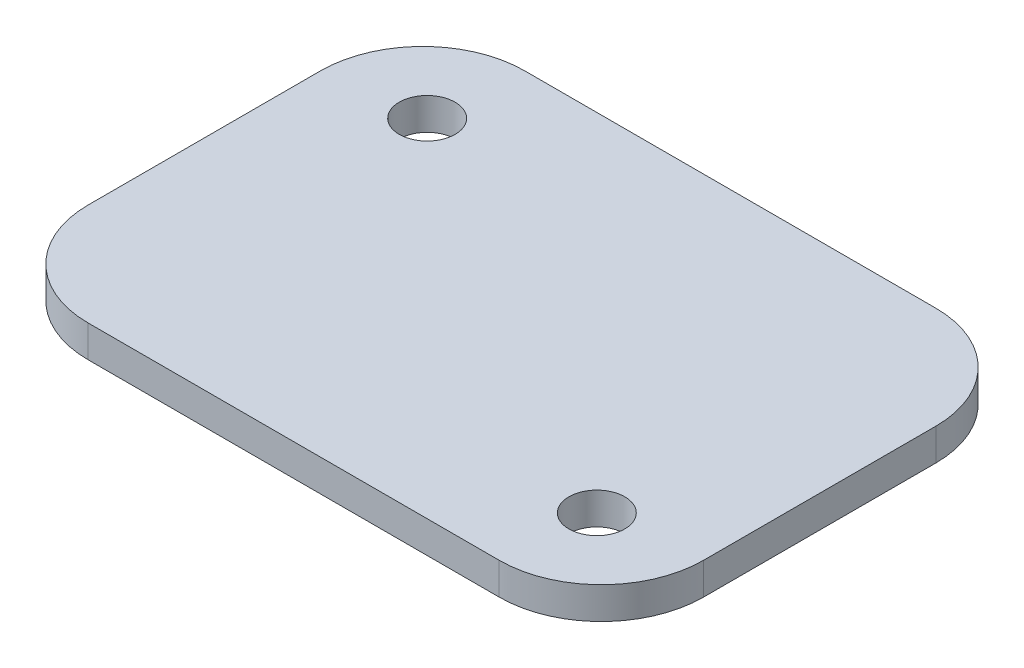
ISO-10303-21;
HEADER;
FILE_DESCRIPTION(('STEP AP214'),'2;1');
FILE_NAME('part.step','',(''),(''),'','','');
FILE_SCHEMA(('AUTOMOTIVE_DESIGN { 1 0 10303 214 1 1 1 1 }'));
ENDSEC;
DATA;
#1=APPLICATION_CONTEXT('core data for automotive mechanical design processes');
#2=APPLICATION_PROTOCOL_DEFINITION('international standard','automotive_design',2000,#1);
#3=PRODUCT_CONTEXT('',#1,'mechanical');
#4=PRODUCT('Part','Part','',(#3));
#5=PRODUCT_RELATED_PRODUCT_CATEGORY('part','',(#4));
#6=PRODUCT_DEFINITION_FORMATION('','',#4);
#7=PRODUCT_DEFINITION_CONTEXT('part definition',#1,'design');
#8=PRODUCT_DEFINITION('design','',#6,#7);
#9=PRODUCT_DEFINITION_SHAPE('','',#8);
#10=(LENGTH_UNIT() NAMED_UNIT(*) SI_UNIT(.MILLI.,.METRE.));
#11=(NAMED_UNIT(*) PLANE_ANGLE_UNIT() SI_UNIT($,.RADIAN.));
#12=(NAMED_UNIT(*) SI_UNIT($,.STERADIAN.) SOLID_ANGLE_UNIT());
#13=UNCERTAINTY_MEASURE_WITH_UNIT(LENGTH_MEASURE(1.E-05),#10,'distance_accuracy_value','');
#14=(GEOMETRIC_REPRESENTATION_CONTEXT(3) GLOBAL_UNCERTAINTY_ASSIGNED_CONTEXT((#13)) GLOBAL_UNIT_ASSIGNED_CONTEXT((#10,
#11,#12)) REPRESENTATION_CONTEXT('',''));
#15=CARTESIAN_POINT('',(0.,0.,0.));
#16=DIRECTION('',(0.,0.,1.));
#17=DIRECTION('',(1.,0.,0.));
#18=AXIS2_PLACEMENT_3D('',#15,#16,#17);
#19=CARTESIAN_POINT('',(20.447,3.175,11.557));
#20=DIRECTION('',(0.,-1.,0.));
#21=DIRECTION('',(0.,0.,-1.));
#22=AXIS2_PLACEMENT_3D('',#19,#20,#21);
#23=PLANE('',#22);
#24=CARTESIAN_POINT('',(21.2145114778184,3.175,12.7769216855043));
#25=DIRECTION('',(0.,1.,0.));
#26=DIRECTION('',(0.,0.,1.));
#27=AXIS2_PLACEMENT_3D('',#24,#25,#26);
#28=CIRCLE('',#27,2.778125);
#29=CARTESIAN_POINT('',(21.2145114778184,3.175,15.5550466855043));
#30=VERTEX_POINT('',#29);
#31=EDGE_CURVE('E180',#30,#30,#28,.T.);
#32=ORIENTED_EDGE('',*,*,#31,.F.);
#33=EDGE_LOOP('',(#32));
#34=FACE_BOUND('',#33,.T.);
#35=CARTESIAN_POINT('',(20.447,3.175,11.557));
#36=DIRECTION('',(0.,1.,0.));
#37=DIRECTION('',(0.,0.,-1.));
#38=AXIS2_PLACEMENT_3D('',#35,#36,#37);
#39=CIRCLE('',#38,10.16);
#40=CARTESIAN_POINT('',(20.4469999999999,3.175,21.717));
#41=VERTEX_POINT('',#40);
#42=CARTESIAN_POINT('',(30.607,3.175,11.5569999999999));
#43=VERTEX_POINT('',#42);
#44=EDGE_CURVE('E145',#41,#43,#39,.T.);
#45=ORIENTED_EDGE('',*,*,#44,.T.);
#46=DIRECTION('',(0.,0.,-1.));
#47=VECTOR('',#46,1.);
#48=CARTESIAN_POINT('',(30.607,3.175,11.5569999999999));
#49=LINE('',#48,#47);
#50=CARTESIAN_POINT('',(30.607,3.175,-11.5569999999999));
#51=VERTEX_POINT('',#50);
#52=EDGE_CURVE('E93',#43,#51,#49,.T.);
#53=ORIENTED_EDGE('',*,*,#52,.T.);
#54=CARTESIAN_POINT('',(20.447,3.175,-11.557));
#55=DIRECTION('',(0.,1.,0.));
#56=DIRECTION('',(0.,0.,1.));
#57=AXIS2_PLACEMENT_3D('',#54,#55,#56);
#58=CIRCLE('',#57,10.16);
#59=CARTESIAN_POINT('',(20.4469999999999,3.175,-21.717));
#60=VERTEX_POINT('',#59);
#61=EDGE_CURVE('E160',#51,#60,#58,.T.);
#62=ORIENTED_EDGE('',*,*,#61,.T.);
#63=DIRECTION('',(-1.,0.,0.));
#64=VECTOR('',#63,1.);
#65=CARTESIAN_POINT('',(-20.4469999999999,3.175,-21.717));
#66=LINE('',#65,#64);
#67=CARTESIAN_POINT('',(-20.4469999999999,3.175,-21.717));
#68=VERTEX_POINT('',#67);
#69=EDGE_CURVE('E172',#60,#68,#66,.T.);
#70=ORIENTED_EDGE('',*,*,#69,.T.);
#71=CARTESIAN_POINT('',(-20.447,3.175,-11.557));
#72=DIRECTION('',(0.,1.,0.));
#73=DIRECTION('',(0.,0.,-1.));
#74=AXIS2_PLACEMENT_3D('',#71,#72,#73);
#75=CIRCLE('',#74,10.16);
#76=CARTESIAN_POINT('',(-30.607,3.175,-11.5569999999999));
#77=VERTEX_POINT('',#76);
#78=EDGE_CURVE('E112',#68,#77,#75,.T.);
#79=ORIENTED_EDGE('',*,*,#78,.T.);
#80=DIRECTION('',(0.,0.,1.));
#81=VECTOR('',#80,1.);
#82=CARTESIAN_POINT('',(-30.607,3.175,11.5569999999999));
#83=LINE('',#82,#81);
#84=CARTESIAN_POINT('',(-30.607,3.175,11.5569999999999));
#85=VERTEX_POINT('',#84);
#86=EDGE_CURVE('E106',#77,#85,#83,.T.);
#87=ORIENTED_EDGE('',*,*,#86,.T.);
#88=CARTESIAN_POINT('',(-20.447,3.175,11.557));
#89=DIRECTION('',(0.,1.,0.));
#90=DIRECTION('',(0.,0.,-1.));
#91=AXIS2_PLACEMENT_3D('',#88,#89,#90);
#92=CIRCLE('',#91,10.16);
#93=CARTESIAN_POINT('',(-20.4469999999999,3.175,21.717));
#94=VERTEX_POINT('',#93);
#95=EDGE_CURVE('E110',#85,#94,#92,.T.);
#96=ORIENTED_EDGE('',*,*,#95,.T.);
#97=DIRECTION('',(1.,0.,0.));
#98=VECTOR('',#97,1.);
#99=CARTESIAN_POINT('',(-20.4469999999999,3.175,21.717));
#100=LINE('',#99,#98);
#101=EDGE_CURVE('E50',#94,#41,#100,.T.);
#102=ORIENTED_EDGE('',*,*,#101,.T.);
#103=EDGE_LOOP('',(#45,#53,#62,#70,#79,#87,#96,#102));
#104=FACE_BOUND('',#103,.T.);
#105=CARTESIAN_POINT('',(-21.2145114778184,3.175,-12.7769216855043));
#106=DIRECTION('',(0.,1.,0.));
#107=DIRECTION('',(0.,0.,1.));
#108=AXIS2_PLACEMENT_3D('',#105,#106,#107);
#109=CIRCLE('',#108,2.778125);
#110=CARTESIAN_POINT('',(-21.2145114778184,3.175,-9.99879668550428));
#111=VERTEX_POINT('',#110);
#112=EDGE_CURVE('E186',#111,#111,#109,.T.);
#113=ORIENTED_EDGE('',*,*,#112,.F.);
#114=EDGE_LOOP('',(#113));
#115=FACE_BOUND('',#114,.T.);
#116=ADVANCED_FACE('F33',(#34,#104,#115),#23,.F.);
#117=CARTESIAN_POINT('',(20.447,3.175,11.557));
#118=DIRECTION('',(0.,-1.,0.));
#119=DIRECTION('',(0.,0.,-1.));
#120=AXIS2_PLACEMENT_3D('',#117,#118,#119);
#121=CYLINDRICAL_SURFACE('',#120,10.16);
#122=CARTESIAN_POINT('',(20.447,0.,11.557));
#123=DIRECTION('',(0.,1.,0.));
#124=DIRECTION('',(0.,0.,-1.));
#125=AXIS2_PLACEMENT_3D('',#122,#123,#124);
#126=CIRCLE('',#125,10.16);
#127=CARTESIAN_POINT('',(20.4469999999999,0.,21.717));
#128=VERTEX_POINT('',#127);
#129=CARTESIAN_POINT('',(30.607,0.,11.5569999999999));
#130=VERTEX_POINT('',#129);
#131=EDGE_CURVE('E130',#128,#130,#126,.T.);
#132=ORIENTED_EDGE('',*,*,#131,.T.);
#133=DIRECTION('',(0.,-1.,0.));
#134=VECTOR('',#133,1.);
#135=CARTESIAN_POINT('',(30.607,3.175,11.5569999999999));
#136=LINE('',#135,#134);
#137=EDGE_CURVE('E11',#43,#130,#136,.T.);
#138=ORIENTED_EDGE('',*,*,#137,.F.);
#139=ORIENTED_EDGE('',*,*,#44,.F.);
#140=DIRECTION('',(0.,-1.,0.));
#141=VECTOR('',#140,1.);
#142=CARTESIAN_POINT('',(20.4469999999999,3.175,21.717));
#143=LINE('',#142,#141);
#144=EDGE_CURVE('E126',#41,#128,#143,.T.);
#145=ORIENTED_EDGE('',*,*,#144,.T.);
#146=EDGE_LOOP('',(#132,#138,#139,#145));
#147=FACE_BOUND('',#146,.T.);
#148=ADVANCED_FACE('F35',(#147),#121,.T.);
#149=CARTESIAN_POINT('',(30.607,3.175,11.5569999999999));
#150=DIRECTION('',(-1.,0.,0.));
#151=DIRECTION('',(0.,0.,1.));
#152=AXIS2_PLACEMENT_3D('',#149,#150,#151);
#153=PLANE('',#152);
#154=DIRECTION('',(0.,0.,-1.));
#155=VECTOR('',#154,1.);
#156=CARTESIAN_POINT('',(30.607,0.,11.5569999999999));
#157=LINE('',#156,#155);
#158=CARTESIAN_POINT('',(30.607,0.,-11.5569999999999));
#159=VERTEX_POINT('',#158);
#160=EDGE_CURVE('E133',#130,#159,#157,.T.);
#161=ORIENTED_EDGE('',*,*,#160,.T.);
#162=DIRECTION('',(0.,-1.,0.));
#163=VECTOR('',#162,1.);
#164=CARTESIAN_POINT('',(30.607,3.175,-11.5569999999999));
#165=LINE('',#164,#163);
#166=EDGE_CURVE('E42',#51,#159,#165,.T.);
#167=ORIENTED_EDGE('',*,*,#166,.F.);
#168=ORIENTED_EDGE('',*,*,#52,.F.);
#169=ORIENTED_EDGE('',*,*,#137,.T.);
#170=EDGE_LOOP('',(#161,#167,#168,#169));
#171=FACE_BOUND('',#170,.T.);
#172=ADVANCED_FACE('F197',(#171),#153,.F.);
#173=CARTESIAN_POINT('',(20.447,3.175,-11.557));
#174=DIRECTION('',(0.,-1.,0.));
#175=DIRECTION('',(0.,0.,-1.));
#176=AXIS2_PLACEMENT_3D('',#173,#174,#175);
#177=CYLINDRICAL_SURFACE('',#176,10.16);
#178=CARTESIAN_POINT('',(20.447,0.,-11.557));
#179=DIRECTION('',(0.,1.,0.));
#180=DIRECTION('',(0.,0.,1.));
#181=AXIS2_PLACEMENT_3D('',#178,#179,#180);
#182=CIRCLE('',#181,10.16);
#183=CARTESIAN_POINT('',(20.4469999999999,0.,-21.717));
#184=VERTEX_POINT('',#183);
#185=EDGE_CURVE('E136',#159,#184,#182,.T.);
#186=ORIENTED_EDGE('',*,*,#185,.T.);
#187=DIRECTION('',(0.,-1.,0.));
#188=VECTOR('',#187,1.);
#189=CARTESIAN_POINT('',(20.4469999999999,3.175,-21.717));
#190=LINE('',#189,#188);
#191=EDGE_CURVE('E152',#60,#184,#190,.T.);
#192=ORIENTED_EDGE('',*,*,#191,.F.);
#193=ORIENTED_EDGE('',*,*,#61,.F.);
#194=ORIENTED_EDGE('',*,*,#166,.T.);
#195=EDGE_LOOP('',(#186,#192,#193,#194));
#196=FACE_BOUND('',#195,.T.);
#197=ADVANCED_FACE('F158',(#196),#177,.T.);
#198=CARTESIAN_POINT('',(-20.4469999999999,3.175,-21.717));
#199=DIRECTION('',(0.,0.,1.));
#200=DIRECTION('',(1.,0.,0.));
#201=AXIS2_PLACEMENT_3D('',#198,#199,#200);
#202=PLANE('',#201);
#203=DIRECTION('',(-1.,0.,0.));
#204=VECTOR('',#203,1.);
#205=CARTESIAN_POINT('',(-20.4469999999999,0.,-21.717));
#206=LINE('',#205,#204);
#207=CARTESIAN_POINT('',(-20.4469999999999,0.,-21.717));
#208=VERTEX_POINT('',#207);
#209=EDGE_CURVE('E138',#184,#208,#206,.T.);
#210=ORIENTED_EDGE('',*,*,#209,.T.);
#211=DIRECTION('',(0.,-1.,0.));
#212=VECTOR('',#211,1.);
#213=CARTESIAN_POINT('',(-20.4469999999999,3.175,-21.717));
#214=LINE('',#213,#212);
#215=EDGE_CURVE('E149',#68,#208,#214,.T.);
#216=ORIENTED_EDGE('',*,*,#215,.F.);
#217=ORIENTED_EDGE('',*,*,#69,.F.);
#218=ORIENTED_EDGE('',*,*,#191,.T.);
#219=EDGE_LOOP('',(#210,#216,#217,#218));
#220=FACE_BOUND('',#219,.T.);
#221=ADVANCED_FACE('F168',(#220),#202,.F.);
#222=CARTESIAN_POINT('',(-20.447,3.175,-11.557));
#223=DIRECTION('',(0.,-1.,0.));
#224=DIRECTION('',(0.,0.,-1.));
#225=AXIS2_PLACEMENT_3D('',#222,#223,#224);
#226=CYLINDRICAL_SURFACE('',#225,10.16);
#227=CARTESIAN_POINT('',(-20.447,0.,-11.557));
#228=DIRECTION('',(0.,1.,0.));
#229=DIRECTION('',(0.,0.,-1.));
#230=AXIS2_PLACEMENT_3D('',#227,#228,#229);
#231=CIRCLE('',#230,10.16);
#232=CARTESIAN_POINT('',(-30.607,0.,-11.5569999999999));
#233=VERTEX_POINT('',#232);
#234=EDGE_CURVE('E140',#208,#233,#231,.T.);
#235=ORIENTED_EDGE('',*,*,#234,.T.);
#236=DIRECTION('',(0.,-1.,0.));
#237=VECTOR('',#236,1.);
#238=CARTESIAN_POINT('',(-30.607,3.175,-11.5569999999999));
#239=LINE('',#238,#237);
#240=EDGE_CURVE('E121',#77,#233,#239,.T.);
#241=ORIENTED_EDGE('',*,*,#240,.F.);
#242=ORIENTED_EDGE('',*,*,#78,.F.);
#243=ORIENTED_EDGE('',*,*,#215,.T.);
#244=EDGE_LOOP('',(#235,#241,#242,#243));
#245=FACE_BOUND('',#244,.T.);
#246=ADVANCED_FACE('F171',(#245),#226,.T.);
#247=CARTESIAN_POINT('',(-30.607,3.175,11.5569999999999));
#248=DIRECTION('',(1.,0.,0.));
#249=DIRECTION('',(0.,0.,-1.));
#250=AXIS2_PLACEMENT_3D('',#247,#248,#249);
#251=PLANE('',#250);
#252=DIRECTION('',(0.,0.,1.));
#253=VECTOR('',#252,1.);
#254=CARTESIAN_POINT('',(-30.607,0.,11.5569999999999));
#255=LINE('',#254,#253);
#256=CARTESIAN_POINT('',(-30.607,0.,11.5569999999999));
#257=VERTEX_POINT('',#256);
#258=EDGE_CURVE('E120',#233,#257,#255,.T.);
#259=ORIENTED_EDGE('',*,*,#258,.T.);
#260=DIRECTION('',(0.,-1.,0.));
#261=VECTOR('',#260,1.);
#262=CARTESIAN_POINT('',(-30.607,3.175,11.5569999999999));
#263=LINE('',#262,#261);
#264=EDGE_CURVE('E117',#85,#257,#263,.T.);
#265=ORIENTED_EDGE('',*,*,#264,.F.);
#266=ORIENTED_EDGE('',*,*,#86,.F.);
#267=ORIENTED_EDGE('',*,*,#240,.T.);
#268=EDGE_LOOP('',(#259,#265,#266,#267));
#269=FACE_BOUND('',#268,.T.);
#270=ADVANCED_FACE('F118',(#269),#251,.F.);
#271=CARTESIAN_POINT('',(-20.447,3.175,11.557));
#272=DIRECTION('',(0.,-1.,0.));
#273=DIRECTION('',(0.,0.,-1.));
#274=AXIS2_PLACEMENT_3D('',#271,#272,#273);
#275=CYLINDRICAL_SURFACE('',#274,10.16);
#276=CARTESIAN_POINT('',(-20.447,0.,11.557));
#277=DIRECTION('',(0.,1.,0.));
#278=DIRECTION('',(0.,0.,-1.));
#279=AXIS2_PLACEMENT_3D('',#276,#277,#278);
#280=CIRCLE('',#279,10.16);
#281=CARTESIAN_POINT('',(-20.4469999999999,0.,21.717));
#282=VERTEX_POINT('',#281);
#283=EDGE_CURVE('E79',#257,#282,#280,.T.);
#284=ORIENTED_EDGE('',*,*,#283,.T.);
#285=DIRECTION('',(0.,-1.,0.));
#286=VECTOR('',#285,1.);
#287=CARTESIAN_POINT('',(-20.4469999999999,3.175,21.717));
#288=LINE('',#287,#286);
#289=EDGE_CURVE('E122',#94,#282,#288,.T.);
#290=ORIENTED_EDGE('',*,*,#289,.F.);
#291=ORIENTED_EDGE('',*,*,#95,.F.);
#292=ORIENTED_EDGE('',*,*,#264,.T.);
#293=EDGE_LOOP('',(#284,#290,#291,#292));
#294=FACE_BOUND('',#293,.T.);
#295=ADVANCED_FACE('F124',(#294),#275,.T.);
#296=CARTESIAN_POINT('',(-20.4469999999999,3.175,21.717));
#297=DIRECTION('',(0.,0.,-1.));
#298=DIRECTION('',(-1.,0.,0.));
#299=AXIS2_PLACEMENT_3D('',#296,#297,#298);
#300=PLANE('',#299);
#301=DIRECTION('',(1.,0.,0.));
#302=VECTOR('',#301,1.);
#303=CARTESIAN_POINT('',(-20.4469999999999,0.,21.717));
#304=LINE('',#303,#302);
#305=EDGE_CURVE('E85',#282,#128,#304,.T.);
#306=ORIENTED_EDGE('',*,*,#305,.T.);
#307=ORIENTED_EDGE('',*,*,#144,.F.);
#308=ORIENTED_EDGE('',*,*,#101,.F.);
#309=ORIENTED_EDGE('',*,*,#289,.T.);
#310=EDGE_LOOP('',(#306,#307,#308,#309));
#311=FACE_BOUND('',#310,.T.);
#312=ADVANCED_FACE('F206',(#311),#300,.F.);
#313=CARTESIAN_POINT('',(20.447,0.,11.557));
#314=DIRECTION('',(0.,-1.,0.));
#315=DIRECTION('',(0.,0.,-1.));
#316=AXIS2_PLACEMENT_3D('',#313,#314,#315);
#317=PLANE('',#316);
#318=CARTESIAN_POINT('',(-21.2145114778184,0.,-12.7769216855043));
#319=DIRECTION('',(0.,1.,0.));
#320=DIRECTION('',(0.,0.,1.));
#321=AXIS2_PLACEMENT_3D('',#318,#319,#320);
#322=CIRCLE('',#321,2.778125);
#323=CARTESIAN_POINT('',(-21.2145114778184,0.,-9.99879668550428));
#324=VERTEX_POINT('',#323);
#325=EDGE_CURVE('E183',#324,#324,#322,.T.);
#326=ORIENTED_EDGE('',*,*,#325,.T.);
#327=EDGE_LOOP('',(#326));
#328=FACE_BOUND('',#327,.T.);
#329=CARTESIAN_POINT('',(21.2145114778184,0.,12.7769216855043));
#330=DIRECTION('',(0.,1.,0.));
#331=DIRECTION('',(0.,0.,1.));
#332=AXIS2_PLACEMENT_3D('',#329,#330,#331);
#333=CIRCLE('',#332,2.778125);
#334=CARTESIAN_POINT('',(21.2145114778184,0.,15.5550466855043));
#335=VERTEX_POINT('',#334);
#336=EDGE_CURVE('E134',#335,#335,#333,.T.);
#337=ORIENTED_EDGE('',*,*,#336,.T.);
#338=EDGE_LOOP('',(#337));
#339=FACE_BOUND('',#338,.T.);
#340=ORIENTED_EDGE('',*,*,#131,.F.);
#341=ORIENTED_EDGE('',*,*,#305,.F.);
#342=ORIENTED_EDGE('',*,*,#283,.F.);
#343=ORIENTED_EDGE('',*,*,#258,.F.);
#344=ORIENTED_EDGE('',*,*,#234,.F.);
#345=ORIENTED_EDGE('',*,*,#209,.F.);
#346=ORIENTED_EDGE('',*,*,#185,.F.);
#347=ORIENTED_EDGE('',*,*,#160,.F.);
#348=EDGE_LOOP('',(#340,#341,#342,#343,#344,#345,#346,#347));
#349=FACE_BOUND('',#348,.T.);
#350=ADVANCED_FACE('F164',(#328,#339,#349),#317,.T.);
#351=CARTESIAN_POINT('',(21.2145114778184,3.175,12.7769216855043));
#352=DIRECTION('',(0.,1.,0.));
#353=DIRECTION('',(0.,0.,1.));
#354=AXIS2_PLACEMENT_3D('',#351,#352,#353);
#355=CYLINDRICAL_SURFACE('',#354,2.778125);
#356=ORIENTED_EDGE('',*,*,#336,.F.);
#357=EDGE_LOOP('',(#356));
#358=FACE_BOUND('',#357,.T.);
#359=ORIENTED_EDGE('',*,*,#31,.T.);
#360=EDGE_LOOP('',(#359));
#361=FACE_BOUND('',#360,.T.);
#362=ADVANCED_FACE('F202',(#358,#361),#355,.F.);
#363=CARTESIAN_POINT('',(-21.2145114778184,3.175,-12.7769216855043));
#364=DIRECTION('',(0.,1.,0.));
#365=DIRECTION('',(0.,0.,1.));
#366=AXIS2_PLACEMENT_3D('',#363,#364,#365);
#367=CYLINDRICAL_SURFACE('',#366,2.778125);
#368=ORIENTED_EDGE('',*,*,#325,.F.);
#369=EDGE_LOOP('',(#368));
#370=FACE_BOUND('',#369,.T.);
#371=ORIENTED_EDGE('',*,*,#112,.T.);
#372=EDGE_LOOP('',(#371));
#373=FACE_BOUND('',#372,.T.);
#374=ADVANCED_FACE('F190',(#370,#373),#367,.F.);
#375=CLOSED_SHELL('',(#116,#148,#172,#197,#221,#246,#270,#295,#312,#350,#362,#374));
#376=MANIFOLD_SOLID_BREP('B2',#375);
#377=ADVANCED_BREP_SHAPE_REPRESENTATION('',(#18,#376),#14);
#378=SHAPE_DEFINITION_REPRESENTATION(#9,#377);
ENDSEC;
END-ISO-10303-21;
